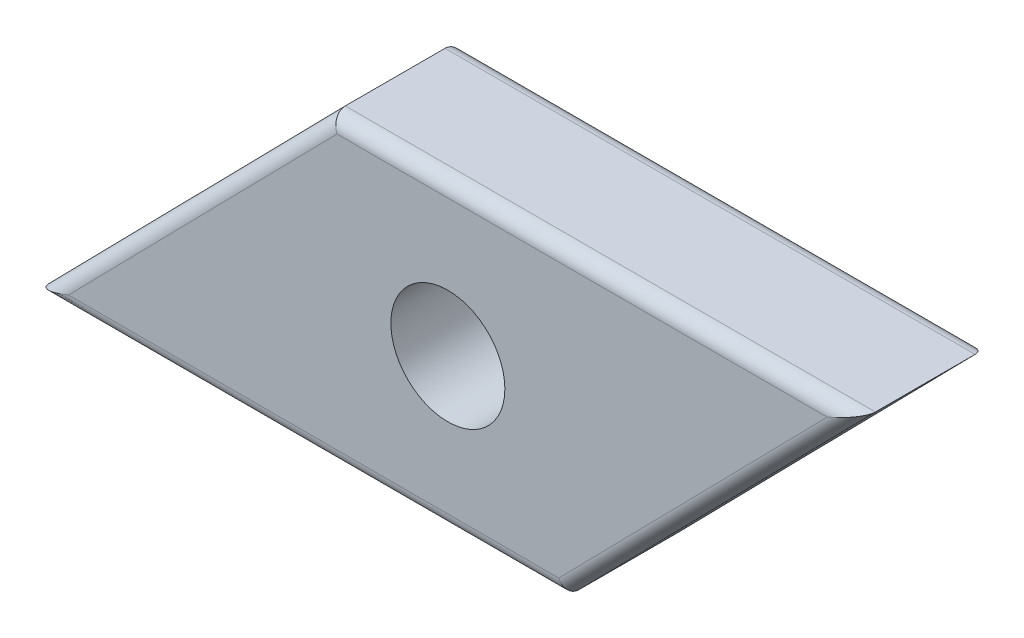
ISO-10303-21;
HEADER;
FILE_DESCRIPTION(('STEP AP214'),'2;1');
FILE_NAME('part.step','',(''),(''),'','','');
FILE_SCHEMA(('AUTOMOTIVE_DESIGN { 1 0 10303 214 1 1 1 1 }'));
ENDSEC;
DATA;
#1=APPLICATION_CONTEXT('core data for automotive mechanical design processes');
#2=APPLICATION_PROTOCOL_DEFINITION('international standard','automotive_design',2000,#1);
#3=PRODUCT_CONTEXT('',#1,'mechanical');
#4=PRODUCT('Part','Part','',(#3));
#5=PRODUCT_RELATED_PRODUCT_CATEGORY('part','',(#4));
#6=PRODUCT_DEFINITION_FORMATION('','',#4);
#7=PRODUCT_DEFINITION_CONTEXT('part definition',#1,'design');
#8=PRODUCT_DEFINITION('design','',#6,#7);
#9=PRODUCT_DEFINITION_SHAPE('','',#8);
#10=(LENGTH_UNIT() NAMED_UNIT(*) SI_UNIT(.MILLI.,.METRE.));
#11=(NAMED_UNIT(*) PLANE_ANGLE_UNIT() SI_UNIT($,.RADIAN.));
#12=(NAMED_UNIT(*) SI_UNIT($,.STERADIAN.) SOLID_ANGLE_UNIT());
#13=UNCERTAINTY_MEASURE_WITH_UNIT(LENGTH_MEASURE(1.E-05),#10,'distance_accuracy_value','');
#14=(GEOMETRIC_REPRESENTATION_CONTEXT(3) GLOBAL_UNCERTAINTY_ASSIGNED_CONTEXT((#13)) GLOBAL_UNIT_ASSIGNED_CONTEXT((#10,
#11,#12)) REPRESENTATION_CONTEXT('',''));
#15=CARTESIAN_POINT('',(0.,0.,0.));
#16=DIRECTION('',(0.,0.,1.));
#17=DIRECTION('',(1.,0.,0.));
#18=AXIS2_PLACEMENT_3D('',#15,#16,#17);
#19=CARTESIAN_POINT('',(0.,0.,4.5));
#20=DIRECTION('',(0.,0.,-1.));
#21=DIRECTION('',(-1.,0.,0.));
#22=AXIS2_PLACEMENT_3D('',#19,#20,#21);
#23=PLANE('',#22);
#24=DIRECTION('',(1.,0.,0.));
#25=VECTOR('',#24,1.);
#26=CARTESIAN_POINT('',(0.,-4.8,4.5));
#27=LINE('',#26,#25);
#28=CARTESIAN_POINT('',(-13.308966234685,-4.8,4.5));
#29=VERTEX_POINT('',#28);
#30=CARTESIAN_POINT('',(3.89009831015675,-4.8,4.5));
#31=VERTEX_POINT('',#30);
#32=EDGE_CURVE('E115',#29,#31,#27,.T.);
#33=ORIENTED_EDGE('',*,*,#32,.T.);
#34=DIRECTION('',(0.700340670128076,0.713808759938233,0.));
#35=VECTOR('',#34,1.);
#36=CARTESIAN_POINT('',(4.38165901564127,-4.29898620402539,4.5));
#37=LINE('',#36,#35);
#38=CARTESIAN_POINT('',(13.308966234685,4.8,4.5));
#39=VERTEX_POINT('',#38);
#40=EDGE_CURVE('E9',#31,#39,#37,.T.);
#41=ORIENTED_EDGE('',*,*,#40,.T.);
#42=DIRECTION('',(-1.,0.,0.));
#43=VECTOR('',#42,1.);
#44=CARTESIAN_POINT('',(0.,4.8,4.5));
#45=LINE('',#44,#43);
#46=CARTESIAN_POINT('',(-3.89009831015673,4.8,4.5));
#47=VERTEX_POINT('',#46);
#48=EDGE_CURVE('E24',#39,#47,#45,.T.);
#49=ORIENTED_EDGE('',*,*,#48,.T.);
#50=DIRECTION('',(-0.700340670128077,-0.713808759938232,0.));
#51=VECTOR('',#50,1.);
#52=CARTESIAN_POINT('',(-4.38165901564126,4.29898620402539,4.5));
#53=LINE('',#52,#51);
#54=EDGE_CURVE('E133',#47,#29,#53,.T.);
#55=ORIENTED_EDGE('',*,*,#54,.T.);
#56=EDGE_LOOP('',(#33,#41,#49,#55));
#57=FACE_BOUND('',#56,.T.);
#58=CARTESIAN_POINT('',(0.,0.,4.5));
#59=DIRECTION('',(0.,0.,1.));
#60=DIRECTION('',(1.,0.,0.));
#61=AXIS2_PLACEMENT_3D('',#58,#59,#60);
#62=CIRCLE('',#61,2.);
#63=CARTESIAN_POINT('',(2.,0.,4.5));
#64=VERTEX_POINT('',#63);
#65=EDGE_CURVE('E160',#64,#64,#62,.T.);
#66=ORIENTED_EDGE('',*,*,#65,.F.);
#67=EDGE_LOOP('',(#66));
#68=FACE_BOUND('',#67,.T.);
#69=ADVANCED_FACE('F15',(#57,#68),#23,.F.);
#70=CARTESIAN_POINT('',(0.,0.,0.));
#71=DIRECTION('',(0.,0.,-1.));
#72=DIRECTION('',(-1.,0.,0.));
#73=AXIS2_PLACEMENT_3D('',#70,#71,#72);
#74=PLANE('',#73);
#75=DIRECTION('',(1.,0.,0.));
#76=VECTOR('',#75,1.);
#77=CARTESIAN_POINT('',(-14.5,-4.8,0.));
#78=LINE('',#77,#76);
#79=CARTESIAN_POINT('',(3.89009831015675,-4.8,0.));
#80=VERTEX_POINT('',#79);
#81=CARTESIAN_POINT('',(-13.308966234685,-4.8,0.));
#82=VERTEX_POINT('',#81);
#83=EDGE_CURVE('E151',#80,#82,#78,.F.);
#84=ORIENTED_EDGE('',*,*,#83,.T.);
#85=DIRECTION('',(-0.700340670128077,-0.713808759938232,0.));
#86=VECTOR('',#85,1.);
#87=CARTESIAN_POINT('',(-3.74309562003089,4.94982966493596,0.));
#88=LINE('',#87,#86);
#89=CARTESIAN_POINT('',(-3.89009831015673,4.8,0.));
#90=VERTEX_POINT('',#89);
#91=EDGE_CURVE('E144',#82,#90,#88,.F.);
#92=ORIENTED_EDGE('',*,*,#91,.T.);
#93=DIRECTION('',(-1.,0.,0.));
#94=VECTOR('',#93,1.);
#95=CARTESIAN_POINT('',(14.5,4.8,0.));
#96=LINE('',#95,#94);
#97=CARTESIAN_POINT('',(13.308966234685,4.8,0.));
#98=VERTEX_POINT('',#97);
#99=EDGE_CURVE('E147',#90,#98,#96,.F.);
#100=ORIENTED_EDGE('',*,*,#99,.T.);
#101=DIRECTION('',(0.700340670128076,0.713808759938233,0.));
#102=VECTOR('',#101,1.);
#103=CARTESIAN_POINT('',(3.74309562003089,-4.94982966493597,0.));
#104=LINE('',#103,#102);
#105=EDGE_CURVE('E149',#98,#80,#104,.F.);
#106=ORIENTED_EDGE('',*,*,#105,.T.);
#107=EDGE_LOOP('',(#84,#92,#100,#106));
#108=FACE_BOUND('',#107,.T.);
#109=CARTESIAN_POINT('',(0.,0.,0.));
#110=DIRECTION('',(0.,0.,1.));
#111=DIRECTION('',(1.,0.,0.));
#112=AXIS2_PLACEMENT_3D('',#109,#110,#111);
#113=CIRCLE('',#112,2.);
#114=CARTESIAN_POINT('',(2.,0.,0.));
#115=VERTEX_POINT('',#114);
#116=EDGE_CURVE('E127',#115,#115,#113,.T.);
#117=ORIENTED_EDGE('',*,*,#116,.T.);
#118=EDGE_LOOP('',(#117));
#119=FACE_BOUND('',#118,.T.);
#120=ADVANCED_FACE('F170',(#108,#119),#74,.T.);
#121=CARTESIAN_POINT('',(-14.5,-5.3,4.5));
#122=DIRECTION('',(0.713808759938232,-0.700340670128077,0.));
#123=DIRECTION('',(0.700340670128077,0.713808759938232,0.));
#124=AXIS2_PLACEMENT_3D('',#121,#122,#123);
#125=PLANE('',#124);
#126=DIRECTION('',(0.,0.,-1.));
#127=VECTOR('',#126,1.);
#128=CARTESIAN_POINT('',(-4.1,5.3,4.5));
#129=LINE('',#128,#127);
#130=CARTESIAN_POINT('',(-4.1,5.3,4.));
#131=VERTEX_POINT('',#130);
#132=CARTESIAN_POINT('',(-4.1,5.3,0.5));
#133=VERTEX_POINT('',#132);
#134=EDGE_CURVE('E158',#131,#133,#129,.T.);
#135=ORIENTED_EDGE('',*,*,#134,.T.);
#136=DIRECTION('',(-0.700340670128077,-0.713808759938232,0.));
#137=VECTOR('',#136,1.);
#138=CARTESIAN_POINT('',(-14.5,-5.3,0.5));
#139=LINE('',#138,#137);
#140=CARTESIAN_POINT('',(-14.5,-5.3,0.5));
#141=VERTEX_POINT('',#140);
#142=EDGE_CURVE('E104',#133,#141,#139,.T.);
#143=ORIENTED_EDGE('',*,*,#142,.T.);
#144=DIRECTION('',(0.,0.,-1.));
#145=VECTOR('',#144,1.);
#146=CARTESIAN_POINT('',(-14.5,-5.3,4.5));
#147=LINE('',#146,#145);
#148=CARTESIAN_POINT('',(-14.5,-5.3,4.));
#149=VERTEX_POINT('',#148);
#150=EDGE_CURVE('E86',#149,#141,#147,.T.);
#151=ORIENTED_EDGE('',*,*,#150,.F.);
#152=DIRECTION('',(-0.700340670128077,-0.713808759938232,0.));
#153=VECTOR('',#152,1.);
#154=CARTESIAN_POINT('',(-14.5,-5.3,4.));
#155=LINE('',#154,#153);
#156=EDGE_CURVE('E101',#149,#131,#155,.F.);
#157=ORIENTED_EDGE('',*,*,#156,.T.);
#158=EDGE_LOOP('',(#135,#143,#151,#157));
#159=FACE_BOUND('',#158,.T.);
#160=ADVANCED_FACE('F100',(#159),#125,.F.);
#161=CARTESIAN_POINT('',(4.10000000000001,-5.3,4.5));
#162=DIRECTION('',(0.,1.,0.));
#163=DIRECTION('',(0.,0.,1.));
#164=AXIS2_PLACEMENT_3D('',#161,#162,#163);
#165=PLANE('',#164);
#166=ORIENTED_EDGE('',*,*,#150,.T.);
#167=DIRECTION('',(1.,0.,0.));
#168=VECTOR('',#167,1.);
#169=CARTESIAN_POINT('',(4.10000000000001,-5.3,0.5));
#170=LINE('',#169,#168);
#171=CARTESIAN_POINT('',(4.10000000000001,-5.3,0.5));
#172=VERTEX_POINT('',#171);
#173=EDGE_CURVE('E93',#141,#172,#170,.T.);
#174=ORIENTED_EDGE('',*,*,#173,.T.);
#175=DIRECTION('',(0.,0.,-1.));
#176=VECTOR('',#175,1.);
#177=CARTESIAN_POINT('',(4.10000000000001,-5.3,4.5));
#178=LINE('',#177,#176);
#179=CARTESIAN_POINT('',(4.10000000000001,-5.3,4.));
#180=VERTEX_POINT('',#179);
#181=EDGE_CURVE('E88',#180,#172,#178,.T.);
#182=ORIENTED_EDGE('',*,*,#181,.F.);
#183=DIRECTION('',(1.,0.,0.));
#184=VECTOR('',#183,1.);
#185=CARTESIAN_POINT('',(4.10000000000001,-5.3,4.));
#186=LINE('',#185,#184);
#187=EDGE_CURVE('E83',#180,#149,#186,.F.);
#188=ORIENTED_EDGE('',*,*,#187,.T.);
#189=EDGE_LOOP('',(#166,#174,#182,#188));
#190=FACE_BOUND('',#189,.T.);
#191=ADVANCED_FACE('F85',(#190),#165,.F.);
#192=CARTESIAN_POINT('',(14.5,5.3,4.5));
#193=DIRECTION('',(-0.713808759938232,0.700340670128076,0.));
#194=DIRECTION('',(-0.700340670128076,-0.713808759938233,0.));
#195=AXIS2_PLACEMENT_3D('',#192,#193,#194);
#196=PLANE('',#195);
#197=ORIENTED_EDGE('',*,*,#181,.T.);
#198=DIRECTION('',(0.700340670128076,0.713808759938233,0.));
#199=VECTOR('',#198,1.);
#200=CARTESIAN_POINT('',(14.5,5.3,0.5));
#201=LINE('',#200,#199);
#202=CARTESIAN_POINT('',(14.5,5.3,0.5));
#203=VERTEX_POINT('',#202);
#204=EDGE_CURVE('E94',#172,#203,#201,.T.);
#205=ORIENTED_EDGE('',*,*,#204,.T.);
#206=DIRECTION('',(0.,0.,-1.));
#207=VECTOR('',#206,1.);
#208=CARTESIAN_POINT('',(14.5,5.3,4.5));
#209=LINE('',#208,#207);
#210=CARTESIAN_POINT('',(14.5,5.3,4.));
#211=VERTEX_POINT('',#210);
#212=EDGE_CURVE('E155',#211,#203,#209,.T.);
#213=ORIENTED_EDGE('',*,*,#212,.F.);
#214=DIRECTION('',(0.700340670128076,0.713808759938233,0.));
#215=VECTOR('',#214,1.);
#216=CARTESIAN_POINT('',(14.5,5.3,4.));
#217=LINE('',#216,#215);
#218=EDGE_CURVE('E138',#211,#180,#217,.F.);
#219=ORIENTED_EDGE('',*,*,#218,.T.);
#220=EDGE_LOOP('',(#197,#205,#213,#219));
#221=FACE_BOUND('',#220,.T.);
#222=ADVANCED_FACE('F183',(#221),#196,.F.);
#223=CARTESIAN_POINT('',(-4.1,5.3,4.5));
#224=DIRECTION('',(0.,-1.,0.));
#225=DIRECTION('',(0.,0.,-1.));
#226=AXIS2_PLACEMENT_3D('',#223,#224,#225);
#227=PLANE('',#226);
#228=ORIENTED_EDGE('',*,*,#212,.T.);
#229=DIRECTION('',(-1.,0.,0.));
#230=VECTOR('',#229,1.);
#231=CARTESIAN_POINT('',(-4.1,5.3,0.5));
#232=LINE('',#231,#230);
#233=EDGE_CURVE('E140',#203,#133,#232,.T.);
#234=ORIENTED_EDGE('',*,*,#233,.T.);
#235=ORIENTED_EDGE('',*,*,#134,.F.);
#236=DIRECTION('',(-1.,0.,0.));
#237=VECTOR('',#236,1.);
#238=CARTESIAN_POINT('',(-4.1,5.3,4.));
#239=LINE('',#238,#237);
#240=EDGE_CURVE('E142',#131,#211,#239,.F.);
#241=ORIENTED_EDGE('',*,*,#240,.T.);
#242=EDGE_LOOP('',(#228,#234,#235,#241));
#243=FACE_BOUND('',#242,.T.);
#244=ADVANCED_FACE('F180',(#243),#227,.F.);
#245=CARTESIAN_POINT('',(0.,0.,4.5));
#246=DIRECTION('',(0.,0.,-1.));
#247=DIRECTION('',(-1.,0.,0.));
#248=AXIS2_PLACEMENT_3D('',#245,#246,#247);
#249=CYLINDRICAL_SURFACE('',#248,2.);
#250=ORIENTED_EDGE('',*,*,#65,.T.);
#251=EDGE_LOOP('',(#250));
#252=FACE_BOUND('',#251,.T.);
#253=ORIENTED_EDGE('',*,*,#116,.F.);
#254=EDGE_LOOP('',(#253));
#255=FACE_BOUND('',#254,.T.);
#256=ADVANCED_FACE('F166',(#252,#255),#249,.F.);
#257=CARTESIAN_POINT('',(14.1430956200309,5.65017033506404,0.5));
#258=DIRECTION('',(-0.700340670128076,-0.713808759938233,0.));
#259=DIRECTION('',(0.713808759938233,-0.700340670128076,0.));
#260=AXIS2_PLACEMENT_3D('',#257,#258,#259);
#261=CYLINDRICAL_SURFACE('',#260,0.5);
#262=CARTESIAN_POINT('',(3.89009831015674,-4.8,0.5));
#263=DIRECTION('',(-0.922046818260352,-0.387078370534911,0.));
#264=DIRECTION('',(-0.387078370534911,0.922046818260352,0.));
#265=AXIS2_PLACEMENT_3D('',#262,#263,#264);
#266=ELLIPSE('',#265,0.542271813207232,0.5);
#267=EDGE_CURVE('E128',#80,#172,#266,.T.);
#268=ORIENTED_EDGE('',*,*,#267,.F.);
#269=ORIENTED_EDGE('',*,*,#105,.F.);
#270=CARTESIAN_POINT('',(13.308966234685,4.8,0.5));
#271=DIRECTION('',(0.387078370534911,-0.922046818260352,0.));
#272=DIRECTION('',(-0.922046818260352,-0.387078370534911,0.));
#273=AXIS2_PLACEMENT_3D('',#270,#271,#272);
#274=ELLIPSE('',#273,1.29172807901676,0.5);
#275=EDGE_CURVE('E124',#203,#98,#274,.F.);
#276=ORIENTED_EDGE('',*,*,#275,.F.);
#277=ORIENTED_EDGE('',*,*,#204,.F.);
#278=EDGE_LOOP('',(#268,#269,#276,#277));
#279=FACE_BOUND('',#278,.T.);
#280=ADVANCED_FACE('F203',(#279),#261,.T.);
#281=CARTESIAN_POINT('',(-4.1,4.8,0.5));
#282=DIRECTION('',(1.,0.,0.));
#283=DIRECTION('',(0.,0.,-1.));
#284=AXIS2_PLACEMENT_3D('',#281,#282,#283);
#285=CYLINDRICAL_SURFACE('',#284,0.5);
#286=ORIENTED_EDGE('',*,*,#275,.T.);
#287=ORIENTED_EDGE('',*,*,#99,.F.);
#288=CARTESIAN_POINT('',(-3.89009831015673,4.8,0.5));
#289=DIRECTION('',(0.922046818260352,0.387078370534911,0.));
#290=DIRECTION('',(0.387078370534911,-0.922046818260352,0.));
#291=AXIS2_PLACEMENT_3D('',#288,#289,#290);
#292=ELLIPSE('',#291,0.542271813207232,0.5);
#293=EDGE_CURVE('E117',#133,#90,#292,.F.);
#294=ORIENTED_EDGE('',*,*,#293,.F.);
#295=ORIENTED_EDGE('',*,*,#233,.F.);
#296=EDGE_LOOP('',(#286,#287,#294,#295));
#297=FACE_BOUND('',#296,.T.);
#298=ADVANCED_FACE('F199',(#297),#285,.T.);
#299=CARTESIAN_POINT('',(4.10000000000001,-4.8,0.5));
#300=DIRECTION('',(-1.,0.,0.));
#301=DIRECTION('',(0.,0.,1.));
#302=AXIS2_PLACEMENT_3D('',#299,#300,#301);
#303=CYLINDRICAL_SURFACE('',#302,0.5);
#304=ORIENTED_EDGE('',*,*,#267,.T.);
#305=ORIENTED_EDGE('',*,*,#173,.F.);
#306=CARTESIAN_POINT('',(-13.308966234685,-4.8,0.5));
#307=DIRECTION('',(-0.387078370534911,0.922046818260352,0.));
#308=DIRECTION('',(-0.922046818260352,-0.387078370534911,0.));
#309=AXIS2_PLACEMENT_3D('',#306,#307,#308);
#310=ELLIPSE('',#309,1.29172807901677,0.5);
#311=EDGE_CURVE('E116',#82,#141,#310,.T.);
#312=ORIENTED_EDGE('',*,*,#311,.F.);
#313=ORIENTED_EDGE('',*,*,#83,.F.);
#314=EDGE_LOOP('',(#304,#305,#312,#313));
#315=FACE_BOUND('',#314,.T.);
#316=ADVANCED_FACE('F195',(#315),#303,.T.);
#317=CARTESIAN_POINT('',(-14.1430956200309,-5.65017033506404,0.5));
#318=DIRECTION('',(0.700340670128077,0.713808759938232,0.));
#319=DIRECTION('',(-0.713808759938232,0.700340670128077,0.));
#320=AXIS2_PLACEMENT_3D('',#317,#318,#319);
#321=CYLINDRICAL_SURFACE('',#320,0.5);
#322=ORIENTED_EDGE('',*,*,#293,.T.);
#323=ORIENTED_EDGE('',*,*,#91,.F.);
#324=ORIENTED_EDGE('',*,*,#311,.T.);
#325=ORIENTED_EDGE('',*,*,#142,.F.);
#326=EDGE_LOOP('',(#322,#323,#324,#325));
#327=FACE_BOUND('',#326,.T.);
#328=ADVANCED_FACE('F192',(#327),#321,.T.);
#329=CARTESIAN_POINT('',(-4.38165901564126,4.29898620402539,4.));
#330=DIRECTION('',(-0.700340670128077,-0.713808759938232,0.));
#331=DIRECTION('',(0.713808759938232,-0.700340670128077,0.));
#332=AXIS2_PLACEMENT_3D('',#329,#330,#331);
#333=CYLINDRICAL_SURFACE('',#332,0.5);
#334=CARTESIAN_POINT('',(-3.89009831015673,4.8,4.));
#335=DIRECTION('',(-0.922046818260352,-0.387078370534911,0.));
#336=DIRECTION('',(0.387078370534911,-0.922046818260352,0.));
#337=AXIS2_PLACEMENT_3D('',#334,#335,#336);
#338=ELLIPSE('',#337,0.542271813207232,0.5);
#339=EDGE_CURVE('E111',#131,#47,#338,.F.);
#340=ORIENTED_EDGE('',*,*,#339,.F.);
#341=ORIENTED_EDGE('',*,*,#156,.F.);
#342=CARTESIAN_POINT('',(-13.308966234685,-4.8,4.));
#343=DIRECTION('',(0.387078370534911,-0.922046818260352,0.));
#344=DIRECTION('',(0.922046818260352,0.387078370534911,0.));
#345=AXIS2_PLACEMENT_3D('',#342,#343,#344);
#346=ELLIPSE('',#345,1.29172807901677,0.5);
#347=EDGE_CURVE('E19',#29,#149,#346,.T.);
#348=ORIENTED_EDGE('',*,*,#347,.F.);
#349=ORIENTED_EDGE('',*,*,#54,.F.);
#350=EDGE_LOOP('',(#340,#341,#348,#349));
#351=FACE_BOUND('',#350,.T.);
#352=ADVANCED_FACE('F17',(#351),#333,.T.);
#353=CARTESIAN_POINT('',(0.,-4.8,4.));
#354=DIRECTION('',(1.,0.,0.));
#355=DIRECTION('',(0.,0.,-1.));
#356=AXIS2_PLACEMENT_3D('',#353,#354,#355);
#357=CYLINDRICAL_SURFACE('',#356,0.5);
#358=ORIENTED_EDGE('',*,*,#347,.T.);
#359=ORIENTED_EDGE('',*,*,#187,.F.);
#360=CARTESIAN_POINT('',(3.89009831015675,-4.8,4.));
#361=DIRECTION('',(0.922046818260352,0.387078370534911,0.));
#362=DIRECTION('',(0.387078370534911,-0.922046818260352,0.));
#363=AXIS2_PLACEMENT_3D('',#360,#361,#362);
#364=ELLIPSE('',#363,0.542271813207232,0.5);
#365=EDGE_CURVE('E119',#31,#180,#364,.T.);
#366=ORIENTED_EDGE('',*,*,#365,.F.);
#367=ORIENTED_EDGE('',*,*,#32,.F.);
#368=EDGE_LOOP('',(#358,#359,#366,#367));
#369=FACE_BOUND('',#368,.T.);
#370=ADVANCED_FACE('F114',(#369),#357,.T.);
#371=CARTESIAN_POINT('',(0.,4.8,4.));
#372=DIRECTION('',(-1.,0.,0.));
#373=DIRECTION('',(0.,0.,1.));
#374=AXIS2_PLACEMENT_3D('',#371,#372,#373);
#375=CYLINDRICAL_SURFACE('',#374,0.5);
#376=ORIENTED_EDGE('',*,*,#339,.T.);
#377=ORIENTED_EDGE('',*,*,#48,.F.);
#378=CARTESIAN_POINT('',(13.308966234685,4.8,4.));
#379=DIRECTION('',(-0.387078370534911,0.922046818260352,0.));
#380=DIRECTION('',(-0.922046818260352,-0.387078370534911,0.));
#381=AXIS2_PLACEMENT_3D('',#378,#379,#380);
#382=ELLIPSE('',#381,1.29172807901676,0.5);
#383=EDGE_CURVE('E32',#211,#39,#382,.F.);
#384=ORIENTED_EDGE('',*,*,#383,.F.);
#385=ORIENTED_EDGE('',*,*,#240,.F.);
#386=EDGE_LOOP('',(#376,#377,#384,#385));
#387=FACE_BOUND('',#386,.T.);
#388=ADVANCED_FACE('F211',(#387),#375,.T.);
#389=CARTESIAN_POINT('',(4.38165901564127,-4.29898620402539,4.));
#390=DIRECTION('',(0.700340670128076,0.713808759938233,0.));
#391=DIRECTION('',(-0.713808759938233,0.700340670128076,0.));
#392=AXIS2_PLACEMENT_3D('',#389,#390,#391);
#393=CYLINDRICAL_SURFACE('',#392,0.5);
#394=ORIENTED_EDGE('',*,*,#365,.T.);
#395=ORIENTED_EDGE('',*,*,#218,.F.);
#396=ORIENTED_EDGE('',*,*,#383,.T.);
#397=ORIENTED_EDGE('',*,*,#40,.F.);
#398=EDGE_LOOP('',(#394,#395,#396,#397));
#399=FACE_BOUND('',#398,.T.);
#400=ADVANCED_FACE('F208',(#399),#393,.T.);
#401=CLOSED_SHELL('',(#69,#120,#160,#191,#222,#244,#256,#280,#298,#316,#328,#352,#370,#388,#400));
#402=MANIFOLD_SOLID_BREP('B1',#401);
#403=ADVANCED_BREP_SHAPE_REPRESENTATION('',(#18,#402),#14);
#404=SHAPE_DEFINITION_REPRESENTATION(#9,#403);
ENDSEC;
END-ISO-10303-21;
